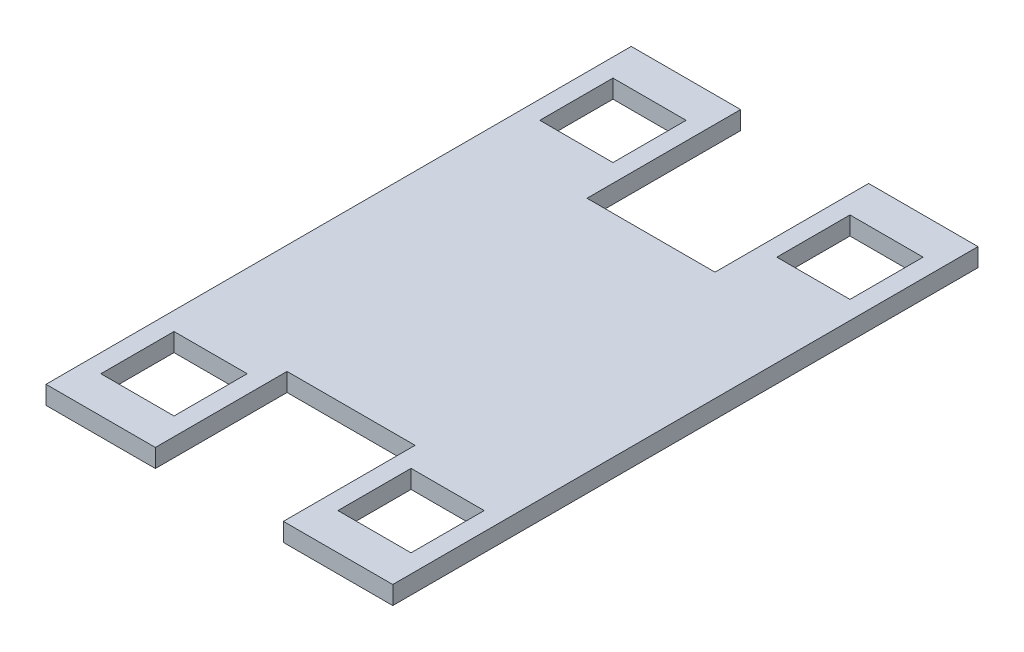
ISO-10303-21;
HEADER;
FILE_DESCRIPTION(('STEP AP214'),'2;1');
FILE_NAME('part.step','',(''),(''),'','','');
FILE_SCHEMA(('AUTOMOTIVE_DESIGN { 1 0 10303 214 1 1 1 1 }'));
ENDSEC;
DATA;
#1=APPLICATION_CONTEXT('core data for automotive mechanical design processes');
#2=APPLICATION_PROTOCOL_DEFINITION('international standard','automotive_design',2000,#1);
#3=PRODUCT_CONTEXT('',#1,'mechanical');
#4=PRODUCT('Part','Part','',(#3));
#5=PRODUCT_RELATED_PRODUCT_CATEGORY('part','',(#4));
#6=PRODUCT_DEFINITION_FORMATION('','',#4);
#7=PRODUCT_DEFINITION_CONTEXT('part definition',#1,'design');
#8=PRODUCT_DEFINITION('design','',#6,#7);
#9=PRODUCT_DEFINITION_SHAPE('','',#8);
#10=(LENGTH_UNIT() NAMED_UNIT(*) SI_UNIT(.MILLI.,.METRE.));
#11=(NAMED_UNIT(*) PLANE_ANGLE_UNIT() SI_UNIT($,.RADIAN.));
#12=(NAMED_UNIT(*) SI_UNIT($,.STERADIAN.) SOLID_ANGLE_UNIT());
#13=UNCERTAINTY_MEASURE_WITH_UNIT(LENGTH_MEASURE(1.E-05),#10,'distance_accuracy_value','');
#14=(GEOMETRIC_REPRESENTATION_CONTEXT(3) GLOBAL_UNCERTAINTY_ASSIGNED_CONTEXT((#13)) GLOBAL_UNIT_ASSIGNED_CONTEXT((#10,
#11,#12)) REPRESENTATION_CONTEXT('',''));
#15=CARTESIAN_POINT('',(0.,0.,0.));
#16=DIRECTION('',(0.,0.,1.));
#17=DIRECTION('',(1.,0.,0.));
#18=AXIS2_PLACEMENT_3D('',#15,#16,#17);
#19=CARTESIAN_POINT('',(-60.198,6.35,-101.6));
#20=DIRECTION('',(0.,0.,1.));
#21=DIRECTION('',(1.,0.,0.));
#22=AXIS2_PLACEMENT_3D('',#19,#20,#21);
#23=PLANE('',#22);
#24=DIRECTION('',(-1.,0.,0.));
#25=VECTOR('',#24,1.);
#26=CARTESIAN_POINT('',(-60.198,0.,-101.6));
#27=LINE('',#26,#25);
#28=CARTESIAN_POINT('',(60.198,0.,-101.6));
#29=VERTEX_POINT('',#28);
#30=CARTESIAN_POINT('',(22.225,0.,-101.6));
#31=VERTEX_POINT('',#30);
#32=EDGE_CURVE('E237',#29,#31,#27,.T.);
#33=ORIENTED_EDGE('',*,*,#32,.T.);
#34=DIRECTION('',(0.,1.,0.));
#35=VECTOR('',#34,1.);
#36=CARTESIAN_POINT('',(22.225,0.,-101.6));
#37=LINE('',#36,#35);
#38=CARTESIAN_POINT('',(22.225,6.35,-101.6));
#39=VERTEX_POINT('',#38);
#40=EDGE_CURVE('E220',#31,#39,#37,.T.);
#41=ORIENTED_EDGE('',*,*,#40,.T.);
#42=DIRECTION('',(-1.,0.,0.));
#43=VECTOR('',#42,1.);
#44=CARTESIAN_POINT('',(-60.198,6.35,-101.6));
#45=LINE('',#44,#43);
#46=CARTESIAN_POINT('',(60.198,6.35,-101.6));
#47=VERTEX_POINT('',#46);
#48=EDGE_CURVE('E289',#47,#39,#45,.T.);
#49=ORIENTED_EDGE('',*,*,#48,.F.);
#50=DIRECTION('',(0.,-1.,0.));
#51=VECTOR('',#50,1.);
#52=CARTESIAN_POINT('',(60.198,6.35,-101.6));
#53=LINE('',#52,#51);
#54=EDGE_CURVE('E11',#47,#29,#53,.T.);
#55=ORIENTED_EDGE('',*,*,#54,.T.);
#56=EDGE_LOOP('',(#33,#41,#49,#55));
#57=FACE_BOUND('',#56,.T.);
#58=ADVANCED_FACE('F35',(#57),#23,.F.);
#59=CARTESIAN_POINT('',(-60.198,6.35,101.6));
#60=DIRECTION('',(0.,0.,-1.));
#61=DIRECTION('',(-1.,0.,0.));
#62=AXIS2_PLACEMENT_3D('',#59,#60,#61);
#63=PLANE('',#62);
#64=DIRECTION('',(1.,0.,0.));
#65=VECTOR('',#64,1.);
#66=CARTESIAN_POINT('',(-60.198,0.,101.6));
#67=LINE('',#66,#65);
#68=CARTESIAN_POINT('',(-60.198,0.,101.6));
#69=VERTEX_POINT('',#68);
#70=CARTESIAN_POINT('',(-22.225,0.,101.6));
#71=VERTEX_POINT('',#70);
#72=EDGE_CURVE('E252',#69,#71,#67,.T.);
#73=ORIENTED_EDGE('',*,*,#72,.T.);
#74=DIRECTION('',(0.,1.,0.));
#75=VECTOR('',#74,1.);
#76=CARTESIAN_POINT('',(-22.225,0.,101.6));
#77=LINE('',#76,#75);
#78=CARTESIAN_POINT('',(-22.225,6.35,101.6));
#79=VERTEX_POINT('',#78);
#80=EDGE_CURVE('E282',#71,#79,#77,.T.);
#81=ORIENTED_EDGE('',*,*,#80,.T.);
#82=DIRECTION('',(1.,0.,0.));
#83=VECTOR('',#82,1.);
#84=CARTESIAN_POINT('',(-60.198,6.35,101.6));
#85=LINE('',#84,#83);
#86=CARTESIAN_POINT('',(-60.198,6.35,101.6));
#87=VERTEX_POINT('',#86);
#88=EDGE_CURVE('E260',#87,#79,#85,.T.);
#89=ORIENTED_EDGE('',*,*,#88,.F.);
#90=DIRECTION('',(0.,-1.,0.));
#91=VECTOR('',#90,1.);
#92=CARTESIAN_POINT('',(-60.198,6.35,101.6));
#93=LINE('',#92,#91);
#94=EDGE_CURVE('E259',#87,#69,#93,.T.);
#95=ORIENTED_EDGE('',*,*,#94,.T.);
#96=EDGE_LOOP('',(#73,#81,#89,#95));
#97=FACE_BOUND('',#96,.T.);
#98=ADVANCED_FACE('F280',(#97),#63,.F.);
#99=CARTESIAN_POINT('',(0.,6.35,0.));
#100=DIRECTION('',(0.,1.,0.));
#101=DIRECTION('',(0.,0.,1.));
#102=AXIS2_PLACEMENT_3D('',#99,#100,#101);
#103=PLANE('',#102);
#104=DIRECTION('',(0.,0.,-1.));
#105=VECTOR('',#104,1.);
#106=CARTESIAN_POINT('',(22.225,6.35,-48.26));
#107=LINE('',#106,#105);
#108=CARTESIAN_POINT('',(22.225,6.35,-48.26));
#109=VERTEX_POINT('',#108);
#110=EDGE_CURVE('E226',#109,#39,#107,.T.);
#111=ORIENTED_EDGE('',*,*,#110,.F.);
#112=DIRECTION('',(1.,0.,0.));
#113=VECTOR('',#112,1.);
#114=CARTESIAN_POINT('',(-22.225,6.35,-48.26));
#115=LINE('',#114,#113);
#116=CARTESIAN_POINT('',(-22.225,6.35,-48.26));
#117=VERTEX_POINT('',#116);
#118=EDGE_CURVE('E239',#117,#109,#115,.T.);
#119=ORIENTED_EDGE('',*,*,#118,.F.);
#120=DIRECTION('',(0.,0.,1.));
#121=VECTOR('',#120,1.);
#122=CARTESIAN_POINT('',(-22.225,6.35,-48.26));
#123=LINE('',#122,#121);
#124=CARTESIAN_POINT('',(-22.225,6.35,-101.6));
#125=VERTEX_POINT('',#124);
#126=EDGE_CURVE('E448',#125,#117,#123,.T.);
#127=ORIENTED_EDGE('',*,*,#126,.F.);
#128=CARTESIAN_POINT('',(-60.198,6.35,-101.6));
#129=VERTEX_POINT('',#128);
#130=EDGE_CURVE('E291',#125,#129,#45,.T.);
#131=ORIENTED_EDGE('',*,*,#130,.T.);
#132=DIRECTION('',(0.,0.,1.));
#133=VECTOR('',#132,1.);
#134=CARTESIAN_POINT('',(-60.198,6.35,-101.6));
#135=LINE('',#134,#133);
#136=EDGE_CURVE('E269',#129,#87,#135,.T.);
#137=ORIENTED_EDGE('',*,*,#136,.T.);
#138=ORIENTED_EDGE('',*,*,#88,.T.);
#139=DIRECTION('',(0.,0.,1.));
#140=VECTOR('',#139,1.);
#141=CARTESIAN_POINT('',(-22.225,6.35,101.6));
#142=LINE('',#141,#140);
#143=CARTESIAN_POINT('',(-22.225,6.35,55.88));
#144=VERTEX_POINT('',#143);
#145=EDGE_CURVE('E437',#144,#79,#142,.T.);
#146=ORIENTED_EDGE('',*,*,#145,.F.);
#147=DIRECTION('',(-1.,0.,0.));
#148=VECTOR('',#147,1.);
#149=CARTESIAN_POINT('',(-22.225,6.35,55.88));
#150=LINE('',#149,#148);
#151=CARTESIAN_POINT('',(22.225,6.35,55.88));
#152=VERTEX_POINT('',#151);
#153=EDGE_CURVE('E431',#152,#144,#150,.T.);
#154=ORIENTED_EDGE('',*,*,#153,.F.);
#155=DIRECTION('',(0.,0.,-1.));
#156=VECTOR('',#155,1.);
#157=CARTESIAN_POINT('',(22.225,6.35,101.6));
#158=LINE('',#157,#156);
#159=CARTESIAN_POINT('',(22.225,6.35,101.6));
#160=VERTEX_POINT('',#159);
#161=EDGE_CURVE('E434',#160,#152,#158,.T.);
#162=ORIENTED_EDGE('',*,*,#161,.F.);
#163=CARTESIAN_POINT('',(60.198,6.35,101.6));
#164=VERTEX_POINT('',#163);
#165=EDGE_CURVE('E286',#160,#164,#85,.T.);
#166=ORIENTED_EDGE('',*,*,#165,.T.);
#167=DIRECTION('',(0.,0.,-1.));
#168=VECTOR('',#167,1.);
#169=CARTESIAN_POINT('',(60.198,6.35,-101.6));
#170=LINE('',#169,#168);
#171=EDGE_CURVE('E255',#164,#47,#170,.T.);
#172=ORIENTED_EDGE('',*,*,#171,.T.);
#173=ORIENTED_EDGE('',*,*,#48,.T.);
#174=EDGE_LOOP('',(#111,#119,#127,#131,#137,#138,#146,#154,#162,#166,#172,#173));
#175=FACE_BOUND('',#174,.T.);
#176=DIRECTION('',(0.,0.,1.));
#177=VECTOR('',#176,1.);
#178=CARTESIAN_POINT('',(28.448,6.35,0.));
#179=LINE('',#178,#177);
#180=CARTESIAN_POINT('',(28.448,6.35,63.5));
#181=VERTEX_POINT('',#180);
#182=CARTESIAN_POINT('',(28.448,6.35,88.9));
#183=VERTEX_POINT('',#182);
#184=EDGE_CURVE('E358',#181,#183,#179,.T.);
#185=ORIENTED_EDGE('',*,*,#184,.F.);
#186=DIRECTION('',(-1.,0.,0.));
#187=VECTOR('',#186,1.);
#188=CARTESIAN_POINT('',(0.,6.35,63.5));
#189=LINE('',#188,#187);
#190=CARTESIAN_POINT('',(53.848,6.35,63.5));
#191=VERTEX_POINT('',#190);
#192=EDGE_CURVE('E361',#191,#181,#189,.T.);
#193=ORIENTED_EDGE('',*,*,#192,.F.);
#194=DIRECTION('',(0.,0.,-1.));
#195=VECTOR('',#194,1.);
#196=CARTESIAN_POINT('',(53.848,6.35,0.));
#197=LINE('',#196,#195);
#198=CARTESIAN_POINT('',(53.848,6.35,88.9));
#199=VERTEX_POINT('',#198);
#200=EDGE_CURVE('E363',#199,#191,#197,.T.);
#201=ORIENTED_EDGE('',*,*,#200,.F.);
#202=DIRECTION('',(1.,0.,0.));
#203=VECTOR('',#202,1.);
#204=CARTESIAN_POINT('',(0.,6.35,88.9));
#205=LINE('',#204,#203);
#206=EDGE_CURVE('E365',#183,#199,#205,.T.);
#207=ORIENTED_EDGE('',*,*,#206,.F.);
#208=EDGE_LOOP('',(#185,#193,#201,#207));
#209=FACE_BOUND('',#208,.T.);
#210=DIRECTION('',(0.,0.,-1.));
#211=VECTOR('',#210,1.);
#212=CARTESIAN_POINT('',(-28.448,6.35,0.));
#213=LINE('',#212,#211);
#214=CARTESIAN_POINT('',(-28.448,6.35,-63.5));
#215=VERTEX_POINT('',#214);
#216=CARTESIAN_POINT('',(-28.448,6.35,-88.9));
#217=VERTEX_POINT('',#216);
#218=EDGE_CURVE('E294',#215,#217,#213,.T.);
#219=ORIENTED_EDGE('',*,*,#218,.F.);
#220=DIRECTION('',(1.,0.,0.));
#221=VECTOR('',#220,1.);
#222=CARTESIAN_POINT('',(0.,6.35,-63.5));
#223=LINE('',#222,#221);
#224=CARTESIAN_POINT('',(-53.848,6.35,-63.5));
#225=VERTEX_POINT('',#224);
#226=EDGE_CURVE('E297',#225,#215,#223,.T.);
#227=ORIENTED_EDGE('',*,*,#226,.F.);
#228=DIRECTION('',(0.,0.,1.));
#229=VECTOR('',#228,1.);
#230=CARTESIAN_POINT('',(-53.848,6.35,0.));
#231=LINE('',#230,#229);
#232=CARTESIAN_POINT('',(-53.848,6.35,-88.9));
#233=VERTEX_POINT('',#232);
#234=EDGE_CURVE('E299',#233,#225,#231,.T.);
#235=ORIENTED_EDGE('',*,*,#234,.F.);
#236=DIRECTION('',(-1.,0.,0.));
#237=VECTOR('',#236,1.);
#238=CARTESIAN_POINT('',(0.,6.35,-88.9));
#239=LINE('',#238,#237);
#240=EDGE_CURVE('E301',#217,#233,#239,.T.);
#241=ORIENTED_EDGE('',*,*,#240,.F.);
#242=EDGE_LOOP('',(#219,#227,#235,#241));
#243=FACE_BOUND('',#242,.T.);
#244=DIRECTION('',(1.,0.,0.));
#245=VECTOR('',#244,1.);
#246=CARTESIAN_POINT('',(0.,6.35,63.5));
#247=LINE('',#246,#245);
#248=CARTESIAN_POINT('',(-53.848,6.35,63.5));
#249=VERTEX_POINT('',#248);
#250=CARTESIAN_POINT('',(-28.448,6.35,63.5));
#251=VERTEX_POINT('',#250);
#252=EDGE_CURVE('E335',#249,#251,#247,.T.);
#253=ORIENTED_EDGE('',*,*,#252,.T.);
#254=DIRECTION('',(0.,0.,1.));
#255=VECTOR('',#254,1.);
#256=CARTESIAN_POINT('',(-28.448,6.35,0.));
#257=LINE('',#256,#255);
#258=CARTESIAN_POINT('',(-28.448,6.35,88.9));
#259=VERTEX_POINT('',#258);
#260=EDGE_CURVE('E326',#251,#259,#257,.T.);
#261=ORIENTED_EDGE('',*,*,#260,.T.);
#262=DIRECTION('',(-1.,0.,0.));
#263=VECTOR('',#262,1.);
#264=CARTESIAN_POINT('',(0.,6.35,88.9));
#265=LINE('',#264,#263);
#266=CARTESIAN_POINT('',(-53.848,6.35,88.9));
#267=VERTEX_POINT('',#266);
#268=EDGE_CURVE('E329',#259,#267,#265,.T.);
#269=ORIENTED_EDGE('',*,*,#268,.T.);
#270=DIRECTION('',(0.,0.,-1.));
#271=VECTOR('',#270,1.);
#272=CARTESIAN_POINT('',(-53.848,6.35,0.));
#273=LINE('',#272,#271);
#274=EDGE_CURVE('E332',#267,#249,#273,.T.);
#275=ORIENTED_EDGE('',*,*,#274,.T.);
#276=EDGE_LOOP('',(#253,#261,#269,#275));
#277=FACE_BOUND('',#276,.T.);
#278=DIRECTION('',(-1.,0.,0.));
#279=VECTOR('',#278,1.);
#280=CARTESIAN_POINT('',(0.,6.35,-63.5));
#281=LINE('',#280,#279);
#282=CARTESIAN_POINT('',(53.848,6.35,-63.5));
#283=VERTEX_POINT('',#282);
#284=CARTESIAN_POINT('',(28.448,6.35,-63.5));
#285=VERTEX_POINT('',#284);
#286=EDGE_CURVE('E399',#283,#285,#281,.T.);
#287=ORIENTED_EDGE('',*,*,#286,.T.);
#288=DIRECTION('',(0.,0.,-1.));
#289=VECTOR('',#288,1.);
#290=CARTESIAN_POINT('',(28.448,6.35,0.));
#291=LINE('',#290,#289);
#292=CARTESIAN_POINT('',(28.448,6.35,-88.9));
#293=VERTEX_POINT('',#292);
#294=EDGE_CURVE('E390',#285,#293,#291,.T.);
#295=ORIENTED_EDGE('',*,*,#294,.T.);
#296=DIRECTION('',(1.,0.,0.));
#297=VECTOR('',#296,1.);
#298=CARTESIAN_POINT('',(0.,6.35,-88.9));
#299=LINE('',#298,#297);
#300=CARTESIAN_POINT('',(53.848,6.35,-88.9));
#301=VERTEX_POINT('',#300);
#302=EDGE_CURVE('E393',#293,#301,#299,.T.);
#303=ORIENTED_EDGE('',*,*,#302,.T.);
#304=DIRECTION('',(0.,0.,1.));
#305=VECTOR('',#304,1.);
#306=CARTESIAN_POINT('',(53.848,6.35,0.));
#307=LINE('',#306,#305);
#308=EDGE_CURVE('E396',#301,#283,#307,.T.);
#309=ORIENTED_EDGE('',*,*,#308,.T.);
#310=EDGE_LOOP('',(#287,#295,#303,#309));
#311=FACE_BOUND('',#310,.T.);
#312=ADVANCED_FACE('F456',(#175,#209,#243,#277,#311),#103,.T.);
#313=CARTESIAN_POINT('',(0.,0.,0.));
#314=DIRECTION('',(0.,1.,0.));
#315=DIRECTION('',(0.,0.,1.));
#316=AXIS2_PLACEMENT_3D('',#313,#314,#315);
#317=PLANE('',#316);
#318=DIRECTION('',(0.,0.,1.));
#319=VECTOR('',#318,1.);
#320=CARTESIAN_POINT('',(-28.448,0.,88.9));
#321=LINE('',#320,#319);
#322=CARTESIAN_POINT('',(-28.448,0.,63.5));
#323=VERTEX_POINT('',#322);
#324=CARTESIAN_POINT('',(-28.448,0.,88.9));
#325=VERTEX_POINT('',#324);
#326=EDGE_CURVE('E356',#323,#325,#321,.T.);
#327=ORIENTED_EDGE('',*,*,#326,.F.);
#328=DIRECTION('',(1.,0.,0.));
#329=VECTOR('',#328,1.);
#330=CARTESIAN_POINT('',(-53.848,0.,63.5));
#331=LINE('',#330,#329);
#332=CARTESIAN_POINT('',(-53.848,0.,63.5));
#333=VERTEX_POINT('',#332);
#334=EDGE_CURVE('E354',#333,#323,#331,.T.);
#335=ORIENTED_EDGE('',*,*,#334,.F.);
#336=DIRECTION('',(0.,0.,-1.));
#337=VECTOR('',#336,1.);
#338=CARTESIAN_POINT('',(-53.848,0.,88.9));
#339=LINE('',#338,#337);
#340=CARTESIAN_POINT('',(-53.848,0.,88.9));
#341=VERTEX_POINT('',#340);
#342=EDGE_CURVE('E351',#341,#333,#339,.T.);
#343=ORIENTED_EDGE('',*,*,#342,.F.);
#344=DIRECTION('',(-1.,0.,0.));
#345=VECTOR('',#344,1.);
#346=CARTESIAN_POINT('',(-53.848,0.,88.9));
#347=LINE('',#346,#345);
#348=EDGE_CURVE('E342',#325,#341,#347,.T.);
#349=ORIENTED_EDGE('',*,*,#348,.F.);
#350=EDGE_LOOP('',(#327,#335,#343,#349));
#351=FACE_BOUND('',#350,.T.);
#352=DIRECTION('',(1.,0.,0.));
#353=VECTOR('',#352,1.);
#354=CARTESIAN_POINT('',(-53.848,0.,-63.5));
#355=LINE('',#354,#353);
#356=CARTESIAN_POINT('',(-53.848,0.,-63.5));
#357=VERTEX_POINT('',#356);
#358=CARTESIAN_POINT('',(-28.448,0.,-63.5));
#359=VERTEX_POINT('',#358);
#360=EDGE_CURVE('E307',#357,#359,#355,.T.);
#361=ORIENTED_EDGE('',*,*,#360,.T.);
#362=DIRECTION('',(0.,0.,-1.));
#363=VECTOR('',#362,1.);
#364=CARTESIAN_POINT('',(-28.448,0.,-88.9));
#365=LINE('',#364,#363);
#366=CARTESIAN_POINT('',(-28.448,0.,-88.9));
#367=VERTEX_POINT('',#366);
#368=EDGE_CURVE('E323',#359,#367,#365,.T.);
#369=ORIENTED_EDGE('',*,*,#368,.T.);
#370=DIRECTION('',(-1.,0.,0.));
#371=VECTOR('',#370,1.);
#372=CARTESIAN_POINT('',(-53.848,0.,-88.9));
#373=LINE('',#372,#371);
#374=CARTESIAN_POINT('',(-53.848,0.,-88.9));
#375=VERTEX_POINT('',#374);
#376=EDGE_CURVE('E320',#367,#375,#373,.T.);
#377=ORIENTED_EDGE('',*,*,#376,.T.);
#378=DIRECTION('',(0.,0.,1.));
#379=VECTOR('',#378,1.);
#380=CARTESIAN_POINT('',(-53.848,0.,-88.9));
#381=LINE('',#380,#379);
#382=EDGE_CURVE('E317',#375,#357,#381,.T.);
#383=ORIENTED_EDGE('',*,*,#382,.T.);
#384=EDGE_LOOP('',(#361,#369,#377,#383));
#385=FACE_BOUND('',#384,.T.);
#386=DIRECTION('',(1.,0.,0.));
#387=VECTOR('',#386,1.);
#388=CARTESIAN_POINT('',(-22.225,0.,-48.26));
#389=LINE('',#388,#387);
#390=CARTESIAN_POINT('',(-22.225,0.,-48.26));
#391=VERTEX_POINT('',#390);
#392=CARTESIAN_POINT('',(22.225,0.,-48.26));
#393=VERTEX_POINT('',#392);
#394=EDGE_CURVE('E231',#391,#393,#389,.T.);
#395=ORIENTED_EDGE('',*,*,#394,.T.);
#396=DIRECTION('',(0.,0.,-1.));
#397=VECTOR('',#396,1.);
#398=CARTESIAN_POINT('',(22.225,0.,-48.26));
#399=LINE('',#398,#397);
#400=EDGE_CURVE('E223',#393,#31,#399,.T.);
#401=ORIENTED_EDGE('',*,*,#400,.T.);
#402=ORIENTED_EDGE('',*,*,#32,.F.);
#403=DIRECTION('',(0.,0.,-1.));
#404=VECTOR('',#403,1.);
#405=CARTESIAN_POINT('',(60.198,0.,-101.6));
#406=LINE('',#405,#404);
#407=CARTESIAN_POINT('',(60.198,0.,101.6));
#408=VERTEX_POINT('',#407);
#409=EDGE_CURVE('E248',#408,#29,#406,.T.);
#410=ORIENTED_EDGE('',*,*,#409,.F.);
#411=CARTESIAN_POINT('',(22.225,0.,101.6));
#412=VERTEX_POINT('',#411);
#413=EDGE_CURVE('E246',#412,#408,#67,.T.);
#414=ORIENTED_EDGE('',*,*,#413,.F.);
#415=DIRECTION('',(0.,0.,-1.));
#416=VECTOR('',#415,1.);
#417=CARTESIAN_POINT('',(22.225,0.,101.6));
#418=LINE('',#417,#416);
#419=CARTESIAN_POINT('',(22.225,0.,55.88));
#420=VERTEX_POINT('',#419);
#421=EDGE_CURVE('E58',#412,#420,#418,.T.);
#422=ORIENTED_EDGE('',*,*,#421,.T.);
#423=DIRECTION('',(-1.,0.,0.));
#424=VECTOR('',#423,1.);
#425=CARTESIAN_POINT('',(-22.225,0.,55.88));
#426=LINE('',#425,#424);
#427=CARTESIAN_POINT('',(-22.225,0.,55.88));
#428=VERTEX_POINT('',#427);
#429=EDGE_CURVE('E425',#420,#428,#426,.T.);
#430=ORIENTED_EDGE('',*,*,#429,.T.);
#431=DIRECTION('',(0.,0.,1.));
#432=VECTOR('',#431,1.);
#433=CARTESIAN_POINT('',(-22.225,0.,101.6));
#434=LINE('',#433,#432);
#435=EDGE_CURVE('E277',#428,#71,#434,.T.);
#436=ORIENTED_EDGE('',*,*,#435,.T.);
#437=ORIENTED_EDGE('',*,*,#72,.F.);
#438=DIRECTION('',(0.,0.,1.));
#439=VECTOR('',#438,1.);
#440=CARTESIAN_POINT('',(-60.198,0.,-101.6));
#441=LINE('',#440,#439);
#442=CARTESIAN_POINT('',(-60.198,0.,-101.6));
#443=VERTEX_POINT('',#442);
#444=EDGE_CURVE('E243',#443,#69,#441,.T.);
#445=ORIENTED_EDGE('',*,*,#444,.F.);
#446=CARTESIAN_POINT('',(-22.225,0.,-101.6));
#447=VERTEX_POINT('',#446);
#448=EDGE_CURVE('E244',#447,#443,#27,.T.);
#449=ORIENTED_EDGE('',*,*,#448,.F.);
#450=DIRECTION('',(0.,0.,1.));
#451=VECTOR('',#450,1.);
#452=CARTESIAN_POINT('',(-22.225,0.,-48.26));
#453=LINE('',#452,#451);
#454=EDGE_CURVE('E50',#447,#391,#453,.T.);
#455=ORIENTED_EDGE('',*,*,#454,.T.);
#456=EDGE_LOOP('',(#395,#401,#402,#410,#414,#422,#430,#436,#437,#445,#449,#455));
#457=FACE_BOUND('',#456,.T.);
#458=DIRECTION('',(-1.,0.,0.));
#459=VECTOR('',#458,1.);
#460=CARTESIAN_POINT('',(53.848,0.,63.5));
#461=LINE('',#460,#459);
#462=CARTESIAN_POINT('',(53.848,0.,63.5));
#463=VERTEX_POINT('',#462);
#464=CARTESIAN_POINT('',(28.448,0.,63.5));
#465=VERTEX_POINT('',#464);
#466=EDGE_CURVE('E371',#463,#465,#461,.T.);
#467=ORIENTED_EDGE('',*,*,#466,.T.);
#468=DIRECTION('',(0.,0.,1.));
#469=VECTOR('',#468,1.);
#470=CARTESIAN_POINT('',(28.448,0.,88.9));
#471=LINE('',#470,#469);
#472=CARTESIAN_POINT('',(28.448,0.,88.9));
#473=VERTEX_POINT('',#472);
#474=EDGE_CURVE('E387',#465,#473,#471,.T.);
#475=ORIENTED_EDGE('',*,*,#474,.T.);
#476=DIRECTION('',(1.,0.,0.));
#477=VECTOR('',#476,1.);
#478=CARTESIAN_POINT('',(53.848,0.,88.9));
#479=LINE('',#478,#477);
#480=CARTESIAN_POINT('',(53.848,0.,88.9));
#481=VERTEX_POINT('',#480);
#482=EDGE_CURVE('E384',#473,#481,#479,.T.);
#483=ORIENTED_EDGE('',*,*,#482,.T.);
#484=DIRECTION('',(0.,0.,-1.));
#485=VECTOR('',#484,1.);
#486=CARTESIAN_POINT('',(53.848,0.,88.9));
#487=LINE('',#486,#485);
#488=EDGE_CURVE('E381',#481,#463,#487,.T.);
#489=ORIENTED_EDGE('',*,*,#488,.T.);
#490=EDGE_LOOP('',(#467,#475,#483,#489));
#491=FACE_BOUND('',#490,.T.);
#492=DIRECTION('',(0.,0.,-1.));
#493=VECTOR('',#492,1.);
#494=CARTESIAN_POINT('',(28.448,0.,-88.9));
#495=LINE('',#494,#493);
#496=CARTESIAN_POINT('',(28.448,0.,-63.5));
#497=VERTEX_POINT('',#496);
#498=CARTESIAN_POINT('',(28.448,0.,-88.9));
#499=VERTEX_POINT('',#498);
#500=EDGE_CURVE('E420',#497,#499,#495,.T.);
#501=ORIENTED_EDGE('',*,*,#500,.F.);
#502=DIRECTION('',(-1.,0.,0.));
#503=VECTOR('',#502,1.);
#504=CARTESIAN_POINT('',(53.848,0.,-63.5));
#505=LINE('',#504,#503);
#506=CARTESIAN_POINT('',(53.848,0.,-63.5));
#507=VERTEX_POINT('',#506);
#508=EDGE_CURVE('E418',#507,#497,#505,.T.);
#509=ORIENTED_EDGE('',*,*,#508,.F.);
#510=DIRECTION('',(0.,0.,1.));
#511=VECTOR('',#510,1.);
#512=CARTESIAN_POINT('',(53.848,0.,-88.9));
#513=LINE('',#512,#511);
#514=CARTESIAN_POINT('',(53.848,0.,-88.9));
#515=VERTEX_POINT('',#514);
#516=EDGE_CURVE('E415',#515,#507,#513,.T.);
#517=ORIENTED_EDGE('',*,*,#516,.F.);
#518=DIRECTION('',(1.,0.,0.));
#519=VECTOR('',#518,1.);
#520=CARTESIAN_POINT('',(53.848,0.,-88.9));
#521=LINE('',#520,#519);
#522=EDGE_CURVE('E406',#499,#515,#521,.T.);
#523=ORIENTED_EDGE('',*,*,#522,.F.);
#524=EDGE_LOOP('',(#501,#509,#517,#523));
#525=FACE_BOUND('',#524,.T.);
#526=ADVANCED_FACE('F234',(#351,#385,#457,#491,#525),#317,.F.);
#527=CARTESIAN_POINT('',(60.198,6.35,-101.6));
#528=DIRECTION('',(-1.,0.,0.));
#529=DIRECTION('',(0.,0.,1.));
#530=AXIS2_PLACEMENT_3D('',#527,#528,#529);
#531=PLANE('',#530);
#532=ORIENTED_EDGE('',*,*,#409,.T.);
#533=ORIENTED_EDGE('',*,*,#54,.F.);
#534=ORIENTED_EDGE('',*,*,#171,.F.);
#535=DIRECTION('',(0.,-1.,0.));
#536=VECTOR('',#535,1.);
#537=CARTESIAN_POINT('',(60.198,6.35,101.6));
#538=LINE('',#537,#536);
#539=EDGE_CURVE('E256',#164,#408,#538,.T.);
#540=ORIENTED_EDGE('',*,*,#539,.T.);
#541=EDGE_LOOP('',(#532,#533,#534,#540));
#542=FACE_BOUND('',#541,.T.);
#543=ADVANCED_FACE('F37',(#542),#531,.F.);
#544=ORIENTED_EDGE('',*,*,#130,.F.);
#545=DIRECTION('',(0.,1.,0.));
#546=VECTOR('',#545,1.);
#547=CARTESIAN_POINT('',(-22.225,0.,-101.6));
#548=LINE('',#547,#546);
#549=EDGE_CURVE('E230',#447,#125,#548,.T.);
#550=ORIENTED_EDGE('',*,*,#549,.F.);
#551=ORIENTED_EDGE('',*,*,#448,.T.);
#552=DIRECTION('',(0.,-1.,0.));
#553=VECTOR('',#552,1.);
#554=CARTESIAN_POINT('',(-60.198,6.35,-101.6));
#555=LINE('',#554,#553);
#556=EDGE_CURVE('E43',#129,#443,#555,.T.);
#557=ORIENTED_EDGE('',*,*,#556,.F.);
#558=EDGE_LOOP('',(#544,#550,#551,#557));
#559=FACE_BOUND('',#558,.T.);
#560=ADVANCED_FACE('F470',(#559),#23,.F.);
#561=CARTESIAN_POINT('',(-60.198,6.35,-101.6));
#562=DIRECTION('',(1.,0.,0.));
#563=DIRECTION('',(0.,0.,-1.));
#564=AXIS2_PLACEMENT_3D('',#561,#562,#563);
#565=PLANE('',#564);
#566=ORIENTED_EDGE('',*,*,#444,.T.);
#567=ORIENTED_EDGE('',*,*,#94,.F.);
#568=ORIENTED_EDGE('',*,*,#136,.F.);
#569=ORIENTED_EDGE('',*,*,#556,.T.);
#570=EDGE_LOOP('',(#566,#567,#568,#569));
#571=FACE_BOUND('',#570,.T.);
#572=ADVANCED_FACE('F267',(#571),#565,.F.);
#573=ORIENTED_EDGE('',*,*,#165,.F.);
#574=DIRECTION('',(0.,1.,0.));
#575=VECTOR('',#574,1.);
#576=CARTESIAN_POINT('',(22.225,0.,101.6));
#577=LINE('',#576,#575);
#578=EDGE_CURVE('E424',#412,#160,#577,.T.);
#579=ORIENTED_EDGE('',*,*,#578,.F.);
#580=ORIENTED_EDGE('',*,*,#413,.T.);
#581=ORIENTED_EDGE('',*,*,#539,.F.);
#582=EDGE_LOOP('',(#573,#579,#580,#581));
#583=FACE_BOUND('',#582,.T.);
#584=ADVANCED_FACE('F475',(#583),#63,.F.);
#585=CARTESIAN_POINT('',(-28.448,0.,-88.9));
#586=DIRECTION('',(1.,0.,0.));
#587=DIRECTION('',(0.,0.,-1.));
#588=AXIS2_PLACEMENT_3D('',#585,#586,#587);
#589=PLANE('',#588);
#590=ORIENTED_EDGE('',*,*,#218,.T.);
#591=DIRECTION('',(0.,1.,0.));
#592=VECTOR('',#591,1.);
#593=CARTESIAN_POINT('',(-28.448,0.,-88.9));
#594=LINE('',#593,#592);
#595=EDGE_CURVE('E304',#367,#217,#594,.T.);
#596=ORIENTED_EDGE('',*,*,#595,.F.);
#597=ORIENTED_EDGE('',*,*,#368,.F.);
#598=DIRECTION('',(0.,1.,0.));
#599=VECTOR('',#598,1.);
#600=CARTESIAN_POINT('',(-28.448,0.,-63.5));
#601=LINE('',#600,#599);
#602=EDGE_CURVE('E303',#359,#215,#601,.T.);
#603=ORIENTED_EDGE('',*,*,#602,.T.);
#604=EDGE_LOOP('',(#590,#596,#597,#603));
#605=FACE_BOUND('',#604,.T.);
#606=ADVANCED_FACE('F561',(#605),#589,.F.);
#607=CARTESIAN_POINT('',(-53.848,0.,-63.5));
#608=DIRECTION('',(0.,0.,1.));
#609=DIRECTION('',(1.,0.,0.));
#610=AXIS2_PLACEMENT_3D('',#607,#608,#609);
#611=PLANE('',#610);
#612=ORIENTED_EDGE('',*,*,#226,.T.);
#613=ORIENTED_EDGE('',*,*,#602,.F.);
#614=ORIENTED_EDGE('',*,*,#360,.F.);
#615=DIRECTION('',(0.,1.,0.));
#616=VECTOR('',#615,1.);
#617=CARTESIAN_POINT('',(-53.848,0.,-63.5));
#618=LINE('',#617,#616);
#619=EDGE_CURVE('E310',#357,#225,#618,.T.);
#620=ORIENTED_EDGE('',*,*,#619,.T.);
#621=EDGE_LOOP('',(#612,#613,#614,#620));
#622=FACE_BOUND('',#621,.T.);
#623=ADVANCED_FACE('F557',(#622),#611,.F.);
#624=CARTESIAN_POINT('',(-53.848,0.,-88.9));
#625=DIRECTION('',(-1.,0.,0.));
#626=DIRECTION('',(0.,0.,1.));
#627=AXIS2_PLACEMENT_3D('',#624,#625,#626);
#628=PLANE('',#627);
#629=ORIENTED_EDGE('',*,*,#234,.T.);
#630=ORIENTED_EDGE('',*,*,#619,.F.);
#631=ORIENTED_EDGE('',*,*,#382,.F.);
#632=DIRECTION('',(0.,1.,0.));
#633=VECTOR('',#632,1.);
#634=CARTESIAN_POINT('',(-53.848,0.,-88.9));
#635=LINE('',#634,#633);
#636=EDGE_CURVE('E306',#375,#233,#635,.T.);
#637=ORIENTED_EDGE('',*,*,#636,.T.);
#638=EDGE_LOOP('',(#629,#630,#631,#637));
#639=FACE_BOUND('',#638,.T.);
#640=ADVANCED_FACE('F560',(#639),#628,.F.);
#641=CARTESIAN_POINT('',(-53.848,0.,-88.9));
#642=DIRECTION('',(0.,0.,-1.));
#643=DIRECTION('',(-1.,0.,0.));
#644=AXIS2_PLACEMENT_3D('',#641,#642,#643);
#645=PLANE('',#644);
#646=ORIENTED_EDGE('',*,*,#240,.T.);
#647=ORIENTED_EDGE('',*,*,#636,.F.);
#648=ORIENTED_EDGE('',*,*,#376,.F.);
#649=ORIENTED_EDGE('',*,*,#595,.T.);
#650=EDGE_LOOP('',(#646,#647,#648,#649));
#651=FACE_BOUND('',#650,.T.);
#652=ADVANCED_FACE('F555',(#651),#645,.F.);
#653=CARTESIAN_POINT('',(-28.448,0.,88.9));
#654=DIRECTION('',(-1.,0.,0.));
#655=DIRECTION('',(0.,0.,1.));
#656=AXIS2_PLACEMENT_3D('',#653,#654,#655);
#657=PLANE('',#656);
#658=DIRECTION('',(0.,1.,0.));
#659=VECTOR('',#658,1.);
#660=CARTESIAN_POINT('',(-28.448,0.,63.5));
#661=LINE('',#660,#659);
#662=EDGE_CURVE('E339',#323,#251,#661,.T.);
#663=ORIENTED_EDGE('',*,*,#662,.F.);
#664=ORIENTED_EDGE('',*,*,#326,.T.);
#665=DIRECTION('',(0.,1.,0.));
#666=VECTOR('',#665,1.);
#667=CARTESIAN_POINT('',(-28.448,0.,88.9));
#668=LINE('',#667,#666);
#669=EDGE_CURVE('E338',#325,#259,#668,.T.);
#670=ORIENTED_EDGE('',*,*,#669,.T.);
#671=ORIENTED_EDGE('',*,*,#260,.F.);
#672=EDGE_LOOP('',(#663,#664,#670,#671));
#673=FACE_BOUND('',#672,.T.);
#674=ADVANCED_FACE('F545',(#673),#657,.T.);
#675=CARTESIAN_POINT('',(-53.848,0.,88.9));
#676=DIRECTION('',(0.,0.,-1.));
#677=DIRECTION('',(-1.,0.,0.));
#678=AXIS2_PLACEMENT_3D('',#675,#676,#677);
#679=PLANE('',#678);
#680=ORIENTED_EDGE('',*,*,#669,.F.);
#681=ORIENTED_EDGE('',*,*,#348,.T.);
#682=DIRECTION('',(0.,1.,0.));
#683=VECTOR('',#682,1.);
#684=CARTESIAN_POINT('',(-53.848,0.,88.9));
#685=LINE('',#684,#683);
#686=EDGE_CURVE('E345',#341,#267,#685,.T.);
#687=ORIENTED_EDGE('',*,*,#686,.T.);
#688=ORIENTED_EDGE('',*,*,#268,.F.);
#689=EDGE_LOOP('',(#680,#681,#687,#688));
#690=FACE_BOUND('',#689,.T.);
#691=ADVANCED_FACE('F541',(#690),#679,.T.);
#692=CARTESIAN_POINT('',(-53.848,0.,88.9));
#693=DIRECTION('',(1.,0.,0.));
#694=DIRECTION('',(0.,0.,-1.));
#695=AXIS2_PLACEMENT_3D('',#692,#693,#694);
#696=PLANE('',#695);
#697=ORIENTED_EDGE('',*,*,#686,.F.);
#698=ORIENTED_EDGE('',*,*,#342,.T.);
#699=DIRECTION('',(0.,1.,0.));
#700=VECTOR('',#699,1.);
#701=CARTESIAN_POINT('',(-53.848,0.,63.5));
#702=LINE('',#701,#700);
#703=EDGE_CURVE('E341',#333,#249,#702,.T.);
#704=ORIENTED_EDGE('',*,*,#703,.T.);
#705=ORIENTED_EDGE('',*,*,#274,.F.);
#706=EDGE_LOOP('',(#697,#698,#704,#705));
#707=FACE_BOUND('',#706,.T.);
#708=ADVANCED_FACE('F544',(#707),#696,.T.);
#709=CARTESIAN_POINT('',(-53.848,0.,63.5));
#710=DIRECTION('',(0.,0.,1.));
#711=DIRECTION('',(1.,0.,0.));
#712=AXIS2_PLACEMENT_3D('',#709,#710,#711);
#713=PLANE('',#712);
#714=ORIENTED_EDGE('',*,*,#703,.F.);
#715=ORIENTED_EDGE('',*,*,#334,.T.);
#716=ORIENTED_EDGE('',*,*,#662,.T.);
#717=ORIENTED_EDGE('',*,*,#252,.F.);
#718=EDGE_LOOP('',(#714,#715,#716,#717));
#719=FACE_BOUND('',#718,.T.);
#720=ADVANCED_FACE('F539',(#719),#713,.T.);
#721=CARTESIAN_POINT('',(28.448,0.,88.9));
#722=DIRECTION('',(-1.,0.,0.));
#723=DIRECTION('',(0.,0.,1.));
#724=AXIS2_PLACEMENT_3D('',#721,#722,#723);
#725=PLANE('',#724);
#726=ORIENTED_EDGE('',*,*,#184,.T.);
#727=DIRECTION('',(0.,1.,0.));
#728=VECTOR('',#727,1.);
#729=CARTESIAN_POINT('',(28.448,0.,88.9));
#730=LINE('',#729,#728);
#731=EDGE_CURVE('E368',#473,#183,#730,.T.);
#732=ORIENTED_EDGE('',*,*,#731,.F.);
#733=ORIENTED_EDGE('',*,*,#474,.F.);
#734=DIRECTION('',(0.,1.,0.));
#735=VECTOR('',#734,1.);
#736=CARTESIAN_POINT('',(28.448,0.,63.5));
#737=LINE('',#736,#735);
#738=EDGE_CURVE('E367',#465,#181,#737,.T.);
#739=ORIENTED_EDGE('',*,*,#738,.T.);
#740=EDGE_LOOP('',(#726,#732,#733,#739));
#741=FACE_BOUND('',#740,.T.);
#742=ADVANCED_FACE('F529',(#741),#725,.F.);
#743=CARTESIAN_POINT('',(53.848,0.,63.5));
#744=DIRECTION('',(0.,0.,-1.));
#745=DIRECTION('',(-1.,0.,0.));
#746=AXIS2_PLACEMENT_3D('',#743,#744,#745);
#747=PLANE('',#746);
#748=ORIENTED_EDGE('',*,*,#192,.T.);
#749=ORIENTED_EDGE('',*,*,#738,.F.);
#750=ORIENTED_EDGE('',*,*,#466,.F.);
#751=DIRECTION('',(0.,1.,0.));
#752=VECTOR('',#751,1.);
#753=CARTESIAN_POINT('',(53.848,0.,63.5));
#754=LINE('',#753,#752);
#755=EDGE_CURVE('E374',#463,#191,#754,.T.);
#756=ORIENTED_EDGE('',*,*,#755,.T.);
#757=EDGE_LOOP('',(#748,#749,#750,#756));
#758=FACE_BOUND('',#757,.T.);
#759=ADVANCED_FACE('F525',(#758),#747,.F.);
#760=CARTESIAN_POINT('',(53.848,0.,88.9));
#761=DIRECTION('',(1.,0.,0.));
#762=DIRECTION('',(0.,0.,-1.));
#763=AXIS2_PLACEMENT_3D('',#760,#761,#762);
#764=PLANE('',#763);
#765=ORIENTED_EDGE('',*,*,#200,.T.);
#766=ORIENTED_EDGE('',*,*,#755,.F.);
#767=ORIENTED_EDGE('',*,*,#488,.F.);
#768=DIRECTION('',(0.,1.,0.));
#769=VECTOR('',#768,1.);
#770=CARTESIAN_POINT('',(53.848,0.,88.9));
#771=LINE('',#770,#769);
#772=EDGE_CURVE('E370',#481,#199,#771,.T.);
#773=ORIENTED_EDGE('',*,*,#772,.T.);
#774=EDGE_LOOP('',(#765,#766,#767,#773));
#775=FACE_BOUND('',#774,.T.);
#776=ADVANCED_FACE('F528',(#775),#764,.F.);
#777=CARTESIAN_POINT('',(53.848,0.,88.9));
#778=DIRECTION('',(0.,0.,1.));
#779=DIRECTION('',(1.,0.,0.));
#780=AXIS2_PLACEMENT_3D('',#777,#778,#779);
#781=PLANE('',#780);
#782=ORIENTED_EDGE('',*,*,#206,.T.);
#783=ORIENTED_EDGE('',*,*,#772,.F.);
#784=ORIENTED_EDGE('',*,*,#482,.F.);
#785=ORIENTED_EDGE('',*,*,#731,.T.);
#786=EDGE_LOOP('',(#782,#783,#784,#785));
#787=FACE_BOUND('',#786,.T.);
#788=ADVANCED_FACE('F523',(#787),#781,.F.);
#789=CARTESIAN_POINT('',(28.448,0.,-88.9));
#790=DIRECTION('',(1.,0.,0.));
#791=DIRECTION('',(0.,0.,-1.));
#792=AXIS2_PLACEMENT_3D('',#789,#790,#791);
#793=PLANE('',#792);
#794=DIRECTION('',(0.,1.,0.));
#795=VECTOR('',#794,1.);
#796=CARTESIAN_POINT('',(28.448,0.,-63.5));
#797=LINE('',#796,#795);
#798=EDGE_CURVE('E403',#497,#285,#797,.T.);
#799=ORIENTED_EDGE('',*,*,#798,.F.);
#800=ORIENTED_EDGE('',*,*,#500,.T.);
#801=DIRECTION('',(0.,1.,0.));
#802=VECTOR('',#801,1.);
#803=CARTESIAN_POINT('',(28.448,0.,-88.9));
#804=LINE('',#803,#802);
#805=EDGE_CURVE('E402',#499,#293,#804,.T.);
#806=ORIENTED_EDGE('',*,*,#805,.T.);
#807=ORIENTED_EDGE('',*,*,#294,.F.);
#808=EDGE_LOOP('',(#799,#800,#806,#807));
#809=FACE_BOUND('',#808,.T.);
#810=ADVANCED_FACE('F516',(#809),#793,.T.);
#811=CARTESIAN_POINT('',(53.848,0.,-88.9));
#812=DIRECTION('',(0.,0.,1.));
#813=DIRECTION('',(1.,0.,0.));
#814=AXIS2_PLACEMENT_3D('',#811,#812,#813);
#815=PLANE('',#814);
#816=ORIENTED_EDGE('',*,*,#805,.F.);
#817=ORIENTED_EDGE('',*,*,#522,.T.);
#818=DIRECTION('',(0.,1.,0.));
#819=VECTOR('',#818,1.);
#820=CARTESIAN_POINT('',(53.848,0.,-88.9));
#821=LINE('',#820,#819);
#822=EDGE_CURVE('E409',#515,#301,#821,.T.);
#823=ORIENTED_EDGE('',*,*,#822,.T.);
#824=ORIENTED_EDGE('',*,*,#302,.F.);
#825=EDGE_LOOP('',(#816,#817,#823,#824));
#826=FACE_BOUND('',#825,.T.);
#827=ADVANCED_FACE('F513',(#826),#815,.T.);
#828=CARTESIAN_POINT('',(53.848,0.,-88.9));
#829=DIRECTION('',(-1.,0.,0.));
#830=DIRECTION('',(0.,0.,1.));
#831=AXIS2_PLACEMENT_3D('',#828,#829,#830);
#832=PLANE('',#831);
#833=ORIENTED_EDGE('',*,*,#822,.F.);
#834=ORIENTED_EDGE('',*,*,#516,.T.);
#835=DIRECTION('',(0.,1.,0.));
#836=VECTOR('',#835,1.);
#837=CARTESIAN_POINT('',(53.848,0.,-63.5));
#838=LINE('',#837,#836);
#839=EDGE_CURVE('E405',#507,#283,#838,.T.);
#840=ORIENTED_EDGE('',*,*,#839,.T.);
#841=ORIENTED_EDGE('',*,*,#308,.F.);
#842=EDGE_LOOP('',(#833,#834,#840,#841));
#843=FACE_BOUND('',#842,.T.);
#844=ADVANCED_FACE('F508',(#843),#832,.T.);
#845=CARTESIAN_POINT('',(53.848,0.,-63.5));
#846=DIRECTION('',(0.,0.,-1.));
#847=DIRECTION('',(-1.,0.,0.));
#848=AXIS2_PLACEMENT_3D('',#845,#846,#847);
#849=PLANE('',#848);
#850=ORIENTED_EDGE('',*,*,#839,.F.);
#851=ORIENTED_EDGE('',*,*,#508,.T.);
#852=ORIENTED_EDGE('',*,*,#798,.T.);
#853=ORIENTED_EDGE('',*,*,#286,.F.);
#854=EDGE_LOOP('',(#850,#851,#852,#853));
#855=FACE_BOUND('',#854,.T.);
#856=ADVANCED_FACE('F501',(#855),#849,.T.);
#857=CARTESIAN_POINT('',(-22.225,0.,101.6));
#858=DIRECTION('',(-1.,0.,0.));
#859=DIRECTION('',(0.,0.,1.));
#860=AXIS2_PLACEMENT_3D('',#857,#858,#859);
#861=PLANE('',#860);
#862=ORIENTED_EDGE('',*,*,#145,.T.);
#863=ORIENTED_EDGE('',*,*,#80,.F.);
#864=ORIENTED_EDGE('',*,*,#435,.F.);
#865=DIRECTION('',(0.,1.,0.));
#866=VECTOR('',#865,1.);
#867=CARTESIAN_POINT('',(-22.225,0.,55.88));
#868=LINE('',#867,#866);
#869=EDGE_CURVE('E429',#428,#144,#868,.T.);
#870=ORIENTED_EDGE('',*,*,#869,.T.);
#871=EDGE_LOOP('',(#862,#863,#864,#870));
#872=FACE_BOUND('',#871,.T.);
#873=ADVANCED_FACE('F499',(#872),#861,.F.);
#874=CARTESIAN_POINT('',(-22.225,0.,55.88));
#875=DIRECTION('',(0.,0.,-1.));
#876=DIRECTION('',(-1.,0.,0.));
#877=AXIS2_PLACEMENT_3D('',#874,#875,#876);
#878=PLANE('',#877);
#879=ORIENTED_EDGE('',*,*,#153,.T.);
#880=ORIENTED_EDGE('',*,*,#869,.F.);
#881=ORIENTED_EDGE('',*,*,#429,.F.);
#882=DIRECTION('',(0.,1.,0.));
#883=VECTOR('',#882,1.);
#884=CARTESIAN_POINT('',(22.225,0.,55.88));
#885=LINE('',#884,#883);
#886=EDGE_CURVE('E427',#420,#152,#885,.T.);
#887=ORIENTED_EDGE('',*,*,#886,.T.);
#888=EDGE_LOOP('',(#879,#880,#881,#887));
#889=FACE_BOUND('',#888,.T.);
#890=ADVANCED_FACE('F496',(#889),#878,.F.);
#891=CARTESIAN_POINT('',(22.225,0.,101.6));
#892=DIRECTION('',(1.,0.,0.));
#893=DIRECTION('',(0.,0.,-1.));
#894=AXIS2_PLACEMENT_3D('',#891,#892,#893);
#895=PLANE('',#894);
#896=ORIENTED_EDGE('',*,*,#161,.T.);
#897=ORIENTED_EDGE('',*,*,#886,.F.);
#898=ORIENTED_EDGE('',*,*,#421,.F.);
#899=ORIENTED_EDGE('',*,*,#578,.T.);
#900=EDGE_LOOP('',(#896,#897,#898,#899));
#901=FACE_BOUND('',#900,.T.);
#902=ADVANCED_FACE('F467',(#901),#895,.F.);
#903=CARTESIAN_POINT('',(22.225,0.,-48.26));
#904=DIRECTION('',(1.,0.,0.));
#905=DIRECTION('',(0.,0.,-1.));
#906=AXIS2_PLACEMENT_3D('',#903,#904,#905);
#907=PLANE('',#906);
#908=ORIENTED_EDGE('',*,*,#110,.T.);
#909=ORIENTED_EDGE('',*,*,#40,.F.);
#910=ORIENTED_EDGE('',*,*,#400,.F.);
#911=DIRECTION('',(0.,1.,0.));
#912=VECTOR('',#911,1.);
#913=CARTESIAN_POINT('',(22.225,0.,-48.26));
#914=LINE('',#913,#912);
#915=EDGE_CURVE('E422',#393,#109,#914,.T.);
#916=ORIENTED_EDGE('',*,*,#915,.T.);
#917=EDGE_LOOP('',(#908,#909,#910,#916));
#918=FACE_BOUND('',#917,.T.);
#919=ADVANCED_FACE('F222',(#918),#907,.F.);
#920=CARTESIAN_POINT('',(-22.225,0.,-48.26));
#921=DIRECTION('',(0.,0.,1.));
#922=DIRECTION('',(1.,0.,0.));
#923=AXIS2_PLACEMENT_3D('',#920,#921,#922);
#924=PLANE('',#923);
#925=ORIENTED_EDGE('',*,*,#118,.T.);
#926=ORIENTED_EDGE('',*,*,#915,.F.);
#927=ORIENTED_EDGE('',*,*,#394,.F.);
#928=DIRECTION('',(0.,1.,0.));
#929=VECTOR('',#928,1.);
#930=CARTESIAN_POINT('',(-22.225,0.,-48.26));
#931=LINE('',#930,#929);
#932=EDGE_CURVE('E443',#391,#117,#931,.T.);
#933=ORIENTED_EDGE('',*,*,#932,.T.);
#934=EDGE_LOOP('',(#925,#926,#927,#933));
#935=FACE_BOUND('',#934,.T.);
#936=ADVANCED_FACE('F459',(#935),#924,.F.);
#937=CARTESIAN_POINT('',(-22.225,0.,-48.26));
#938=DIRECTION('',(-1.,0.,0.));
#939=DIRECTION('',(0.,0.,1.));
#940=AXIS2_PLACEMENT_3D('',#937,#938,#939);
#941=PLANE('',#940);
#942=ORIENTED_EDGE('',*,*,#126,.T.);
#943=ORIENTED_EDGE('',*,*,#932,.F.);
#944=ORIENTED_EDGE('',*,*,#454,.F.);
#945=ORIENTED_EDGE('',*,*,#549,.T.);
#946=EDGE_LOOP('',(#942,#943,#944,#945));
#947=FACE_BOUND('',#946,.T.);
#948=ADVANCED_FACE('F455',(#947),#941,.F.);
#949=CLOSED_SHELL('',(#58,#98,#312,#526,#543,#560,#572,#584,#606,#623,#640,#652,#674,#691,#708,
#720,#742,#759,#776,#788,#810,#827,#844,#856,#873,#890,#902,#919,#936,#948));
#950=MANIFOLD_SOLID_BREP('B2',#949);
#951=ADVANCED_BREP_SHAPE_REPRESENTATION('',(#18,#950),#14);
#952=SHAPE_DEFINITION_REPRESENTATION(#9,#951);
ENDSEC;
END-ISO-10303-21;
